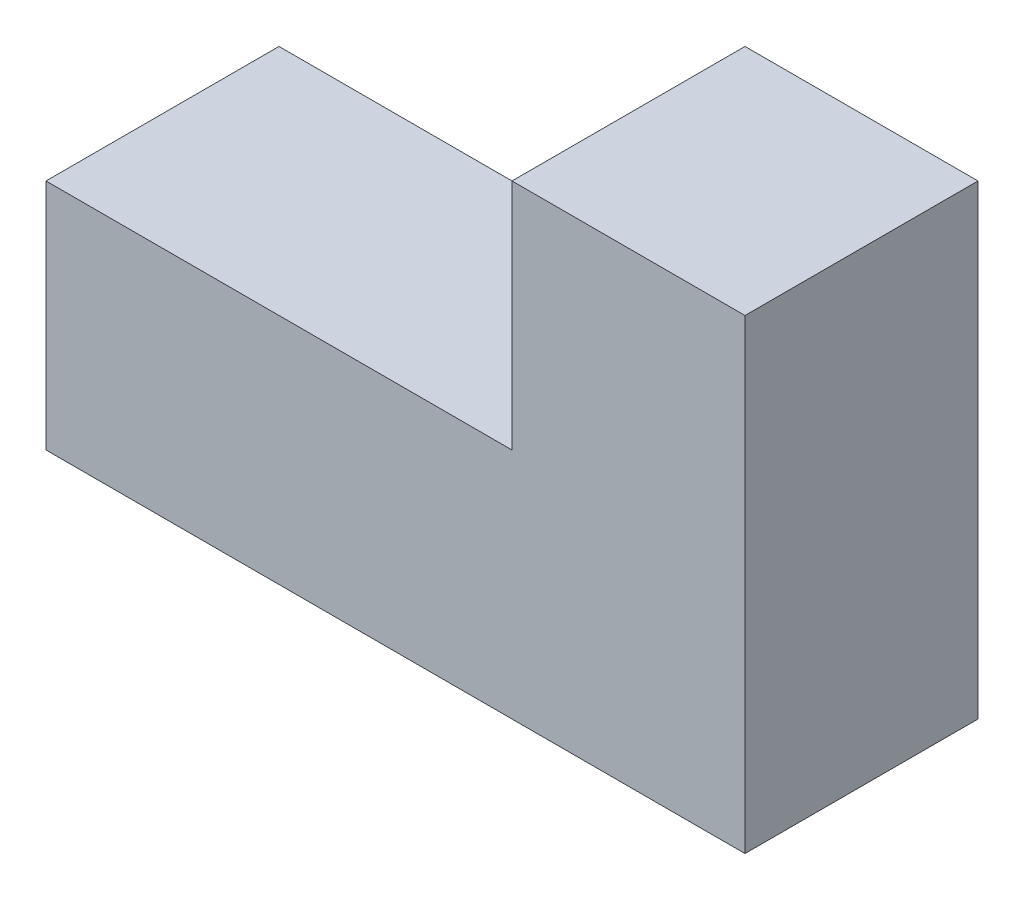
ISO-10303-21;
HEADER;
FILE_DESCRIPTION(('STEP AP214'),'2;1');
FILE_NAME('part.step','',(''),(''),'','','');
FILE_SCHEMA(('AUTOMOTIVE_DESIGN { 1 0 10303 214 1 1 1 1 }'));
ENDSEC;
DATA;
#1=APPLICATION_CONTEXT('core data for automotive mechanical design processes');
#2=APPLICATION_PROTOCOL_DEFINITION('international standard','automotive_design',2000,#1);
#3=PRODUCT_CONTEXT('',#1,'mechanical');
#4=PRODUCT('Part','Part','',(#3));
#5=PRODUCT_RELATED_PRODUCT_CATEGORY('part','',(#4));
#6=PRODUCT_DEFINITION_FORMATION('','',#4);
#7=PRODUCT_DEFINITION_CONTEXT('part definition',#1,'design');
#8=PRODUCT_DEFINITION('design','',#6,#7);
#9=PRODUCT_DEFINITION_SHAPE('','',#8);
#10=(LENGTH_UNIT() NAMED_UNIT(*) SI_UNIT(.MILLI.,.METRE.));
#11=(NAMED_UNIT(*) PLANE_ANGLE_UNIT() SI_UNIT($,.RADIAN.));
#12=(NAMED_UNIT(*) SI_UNIT($,.STERADIAN.) SOLID_ANGLE_UNIT());
#13=UNCERTAINTY_MEASURE_WITH_UNIT(LENGTH_MEASURE(1.E-05),#10,'distance_accuracy_value','');
#14=(GEOMETRIC_REPRESENTATION_CONTEXT(3) GLOBAL_UNCERTAINTY_ASSIGNED_CONTEXT((#13)) GLOBAL_UNIT_ASSIGNED_CONTEXT((#10,
#11,#12)) REPRESENTATION_CONTEXT('',''));
#15=CARTESIAN_POINT('',(0.,0.,0.));
#16=DIRECTION('',(0.,0.,1.));
#17=DIRECTION('',(1.,0.,0.));
#18=AXIS2_PLACEMENT_3D('',#15,#16,#17);
#19=CARTESIAN_POINT('',(0.,30.,30.));
#20=DIRECTION('',(1.,0.,0.));
#21=DIRECTION('',(0.,0.,-1.));
#22=AXIS2_PLACEMENT_3D('',#19,#20,#21);
#23=PLANE('',#22);
#24=DIRECTION('',(0.,-1.,0.));
#25=VECTOR('',#24,1.);
#26=CARTESIAN_POINT('',(0.,30.,0.));
#27=LINE('',#26,#25);
#28=CARTESIAN_POINT('',(0.,30.,0.));
#29=VERTEX_POINT('',#28);
#30=CARTESIAN_POINT('',(0.,0.,0.));
#31=VERTEX_POINT('',#30);
#32=EDGE_CURVE('E117',#29,#31,#27,.T.);
#33=ORIENTED_EDGE('',*,*,#32,.T.);
#34=DIRECTION('',(0.,0.,-1.));
#35=VECTOR('',#34,1.);
#36=CARTESIAN_POINT('',(0.,0.,30.));
#37=LINE('',#36,#35);
#38=CARTESIAN_POINT('',(0.,0.,30.));
#39=VERTEX_POINT('',#38);
#40=EDGE_CURVE('E11',#39,#31,#37,.T.);
#41=ORIENTED_EDGE('',*,*,#40,.F.);
#42=DIRECTION('',(0.,-1.,0.));
#43=VECTOR('',#42,1.);
#44=CARTESIAN_POINT('',(0.,30.,30.));
#45=LINE('',#44,#43);
#46=CARTESIAN_POINT('',(0.,30.,30.));
#47=VERTEX_POINT('',#46);
#48=EDGE_CURVE('E127',#47,#39,#45,.T.);
#49=ORIENTED_EDGE('',*,*,#48,.F.);
#50=DIRECTION('',(0.,0.,-1.));
#51=VECTOR('',#50,1.);
#52=CARTESIAN_POINT('',(0.,30.,30.));
#53=LINE('',#52,#51);
#54=EDGE_CURVE('E113',#47,#29,#53,.T.);
#55=ORIENTED_EDGE('',*,*,#54,.T.);
#56=EDGE_LOOP('',(#33,#41,#49,#55));
#57=FACE_BOUND('',#56,.T.);
#58=ADVANCED_FACE('F33',(#57),#23,.F.);
#59=CARTESIAN_POINT('',(0.,0.,30.));
#60=DIRECTION('',(0.,1.,0.));
#61=DIRECTION('',(0.,0.,1.));
#62=AXIS2_PLACEMENT_3D('',#59,#60,#61);
#63=PLANE('',#62);
#64=DIRECTION('',(1.,0.,0.));
#65=VECTOR('',#64,1.);
#66=CARTESIAN_POINT('',(0.,0.,0.));
#67=LINE('',#66,#65);
#68=CARTESIAN_POINT('',(90.,0.,0.));
#69=VERTEX_POINT('',#68);
#70=EDGE_CURVE('E120',#31,#69,#67,.T.);
#71=ORIENTED_EDGE('',*,*,#70,.T.);
#72=DIRECTION('',(0.,0.,-1.));
#73=VECTOR('',#72,1.);
#74=CARTESIAN_POINT('',(90.,0.,30.));
#75=LINE('',#74,#73);
#76=CARTESIAN_POINT('',(90.,0.,30.));
#77=VERTEX_POINT('',#76);
#78=EDGE_CURVE('E41',#77,#69,#75,.T.);
#79=ORIENTED_EDGE('',*,*,#78,.F.);
#80=DIRECTION('',(1.,0.,0.));
#81=VECTOR('',#80,1.);
#82=CARTESIAN_POINT('',(0.,0.,30.));
#83=LINE('',#82,#81);
#84=EDGE_CURVE('E86',#39,#77,#83,.T.);
#85=ORIENTED_EDGE('',*,*,#84,.F.);
#86=ORIENTED_EDGE('',*,*,#40,.T.);
#87=EDGE_LOOP('',(#71,#79,#85,#86));
#88=FACE_BOUND('',#87,.T.);
#89=ADVANCED_FACE('F151',(#88),#63,.F.);
#90=CARTESIAN_POINT('',(90.,0.,30.));
#91=DIRECTION('',(-1.,0.,0.));
#92=DIRECTION('',(0.,0.,1.));
#93=AXIS2_PLACEMENT_3D('',#90,#91,#92);
#94=PLANE('',#93);
#95=DIRECTION('',(0.,1.,0.));
#96=VECTOR('',#95,1.);
#97=CARTESIAN_POINT('',(90.,0.,0.));
#98=LINE('',#97,#96);
#99=CARTESIAN_POINT('',(90.,60.,0.));
#100=VERTEX_POINT('',#99);
#101=EDGE_CURVE('E122',#69,#100,#98,.T.);
#102=ORIENTED_EDGE('',*,*,#101,.T.);
#103=DIRECTION('',(0.,0.,-1.));
#104=VECTOR('',#103,1.);
#105=CARTESIAN_POINT('',(90.,60.,30.));
#106=LINE('',#105,#104);
#107=CARTESIAN_POINT('',(90.,60.,30.));
#108=VERTEX_POINT('',#107);
#109=EDGE_CURVE('E108',#108,#100,#106,.T.);
#110=ORIENTED_EDGE('',*,*,#109,.F.);
#111=DIRECTION('',(0.,1.,0.));
#112=VECTOR('',#111,1.);
#113=CARTESIAN_POINT('',(90.,0.,30.));
#114=LINE('',#113,#112);
#115=EDGE_CURVE('E99',#77,#108,#114,.T.);
#116=ORIENTED_EDGE('',*,*,#115,.F.);
#117=ORIENTED_EDGE('',*,*,#78,.T.);
#118=EDGE_LOOP('',(#102,#110,#116,#117));
#119=FACE_BOUND('',#118,.T.);
#120=ADVANCED_FACE('F133',(#119),#94,.F.);
#121=CARTESIAN_POINT('',(90.,60.,30.));
#122=DIRECTION('',(0.,-1.,0.));
#123=DIRECTION('',(1.,0.,0.));
#124=AXIS2_PLACEMENT_3D('',#121,#122,#123);
#125=PLANE('',#124);
#126=DIRECTION('',(-1.,0.,0.));
#127=VECTOR('',#126,1.);
#128=CARTESIAN_POINT('',(90.,60.,0.));
#129=LINE('',#128,#127);
#130=CARTESIAN_POINT('',(60.,60.,0.));
#131=VERTEX_POINT('',#130);
#132=EDGE_CURVE('E107',#100,#131,#129,.T.);
#133=ORIENTED_EDGE('',*,*,#132,.T.);
#134=DIRECTION('',(0.,0.,-1.));
#135=VECTOR('',#134,1.);
#136=CARTESIAN_POINT('',(60.,60.,30.));
#137=LINE('',#136,#135);
#138=CARTESIAN_POINT('',(60.,60.,30.));
#139=VERTEX_POINT('',#138);
#140=EDGE_CURVE('E104',#139,#131,#137,.T.);
#141=ORIENTED_EDGE('',*,*,#140,.F.);
#142=DIRECTION('',(-1.,0.,0.));
#143=VECTOR('',#142,1.);
#144=CARTESIAN_POINT('',(90.,60.,30.));
#145=LINE('',#144,#143);
#146=EDGE_CURVE('E93',#108,#139,#145,.T.);
#147=ORIENTED_EDGE('',*,*,#146,.F.);
#148=ORIENTED_EDGE('',*,*,#109,.T.);
#149=EDGE_LOOP('',(#133,#141,#147,#148));
#150=FACE_BOUND('',#149,.T.);
#151=ADVANCED_FACE('F105',(#150),#125,.F.);
#152=CARTESIAN_POINT('',(60.,60.,30.));
#153=DIRECTION('',(1.,0.,0.));
#154=DIRECTION('',(0.,0.,-1.));
#155=AXIS2_PLACEMENT_3D('',#152,#153,#154);
#156=PLANE('',#155);
#157=DIRECTION('',(0.,-1.,0.));
#158=VECTOR('',#157,1.);
#159=CARTESIAN_POINT('',(60.,60.,0.));
#160=LINE('',#159,#158);
#161=CARTESIAN_POINT('',(60.,30.,0.));
#162=VERTEX_POINT('',#161);
#163=EDGE_CURVE('E72',#131,#162,#160,.T.);
#164=ORIENTED_EDGE('',*,*,#163,.T.);
#165=DIRECTION('',(0.,0.,-1.));
#166=VECTOR('',#165,1.);
#167=CARTESIAN_POINT('',(60.,30.,30.));
#168=LINE('',#167,#166);
#169=CARTESIAN_POINT('',(60.,30.,30.));
#170=VERTEX_POINT('',#169);
#171=EDGE_CURVE('E109',#170,#162,#168,.T.);
#172=ORIENTED_EDGE('',*,*,#171,.F.);
#173=DIRECTION('',(0.,-1.,0.));
#174=VECTOR('',#173,1.);
#175=CARTESIAN_POINT('',(60.,60.,30.));
#176=LINE('',#175,#174);
#177=EDGE_CURVE('E97',#139,#170,#176,.T.);
#178=ORIENTED_EDGE('',*,*,#177,.F.);
#179=ORIENTED_EDGE('',*,*,#140,.T.);
#180=EDGE_LOOP('',(#164,#172,#178,#179));
#181=FACE_BOUND('',#180,.T.);
#182=ADVANCED_FACE('F111',(#181),#156,.F.);
#183=CARTESIAN_POINT('',(60.,30.,30.));
#184=DIRECTION('',(0.,-1.,0.));
#185=DIRECTION('',(1.,0.,0.));
#186=AXIS2_PLACEMENT_3D('',#183,#184,#185);
#187=PLANE('',#186);
#188=DIRECTION('',(-1.,0.,0.));
#189=VECTOR('',#188,1.);
#190=CARTESIAN_POINT('',(60.,30.,0.));
#191=LINE('',#190,#189);
#192=EDGE_CURVE('E78',#162,#29,#191,.T.);
#193=ORIENTED_EDGE('',*,*,#192,.T.);
#194=ORIENTED_EDGE('',*,*,#54,.F.);
#195=DIRECTION('',(-1.,0.,0.));
#196=VECTOR('',#195,1.);
#197=CARTESIAN_POINT('',(60.,30.,30.));
#198=LINE('',#197,#196);
#199=EDGE_CURVE('E49',#170,#47,#198,.T.);
#200=ORIENTED_EDGE('',*,*,#199,.F.);
#201=ORIENTED_EDGE('',*,*,#171,.T.);
#202=EDGE_LOOP('',(#193,#194,#200,#201));
#203=FACE_BOUND('',#202,.T.);
#204=ADVANCED_FACE('F140',(#203),#187,.F.);
#205=CARTESIAN_POINT('',(0.,0.,30.));
#206=DIRECTION('',(0.,0.,1.));
#207=DIRECTION('',(1.,0.,0.));
#208=AXIS2_PLACEMENT_3D('',#205,#206,#207);
#209=PLANE('',#208);
#210=ORIENTED_EDGE('',*,*,#48,.T.);
#211=ORIENTED_EDGE('',*,*,#84,.T.);
#212=ORIENTED_EDGE('',*,*,#115,.T.);
#213=ORIENTED_EDGE('',*,*,#146,.T.);
#214=ORIENTED_EDGE('',*,*,#177,.T.);
#215=ORIENTED_EDGE('',*,*,#199,.T.);
#216=EDGE_LOOP('',(#210,#211,#212,#213,#214,#215));
#217=FACE_BOUND('',#216,.T.);
#218=ADVANCED_FACE('F95',(#217),#209,.T.);
#219=CARTESIAN_POINT('',(0.,0.,0.));
#220=DIRECTION('',(0.,0.,1.));
#221=DIRECTION('',(1.,0.,0.));
#222=AXIS2_PLACEMENT_3D('',#219,#220,#221);
#223=PLANE('',#222);
#224=ORIENTED_EDGE('',*,*,#32,.F.);
#225=ORIENTED_EDGE('',*,*,#192,.F.);
#226=ORIENTED_EDGE('',*,*,#163,.F.);
#227=ORIENTED_EDGE('',*,*,#132,.F.);
#228=ORIENTED_EDGE('',*,*,#101,.F.);
#229=ORIENTED_EDGE('',*,*,#70,.F.);
#230=EDGE_LOOP('',(#224,#225,#226,#227,#228,#229));
#231=FACE_BOUND('',#230,.T.);
#232=ADVANCED_FACE('F136',(#231),#223,.F.);
#233=CLOSED_SHELL('',(#58,#89,#120,#151,#182,#204,#218,#232));
#234=MANIFOLD_SOLID_BREP('B2',#233);
#235=ADVANCED_BREP_SHAPE_REPRESENTATION('',(#18,#234),#14);
#236=SHAPE_DEFINITION_REPRESENTATION(#9,#235);
ENDSEC;
END-ISO-10303-21;
